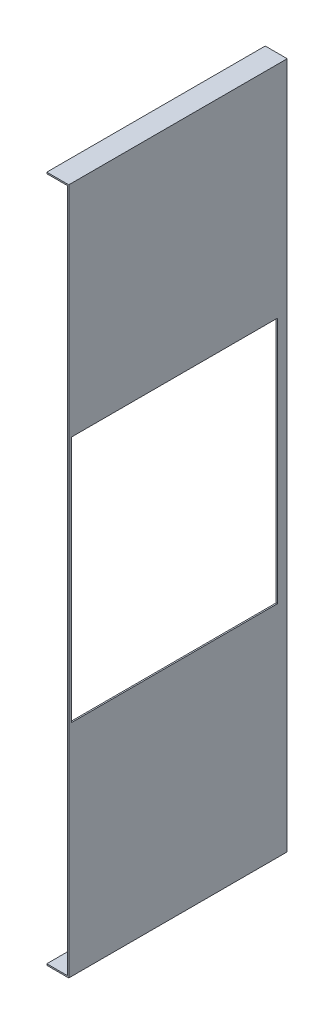
ISO-10303-21;
HEADER;
FILE_DESCRIPTION(('STEP AP214'),'2;1');
FILE_NAME('part.step','',(''),(''),'','','');
FILE_SCHEMA(('AUTOMOTIVE_DESIGN { 1 0 10303 214 1 1 1 1 }'));
ENDSEC;
DATA;
#1=APPLICATION_CONTEXT('core data for automotive mechanical design processes');
#2=APPLICATION_PROTOCOL_DEFINITION('international standard','automotive_design',2000,#1);
#3=PRODUCT_CONTEXT('',#1,'mechanical');
#4=PRODUCT('Part','Part','',(#3));
#5=PRODUCT_RELATED_PRODUCT_CATEGORY('part','',(#4));
#6=PRODUCT_DEFINITION_FORMATION('','',#4);
#7=PRODUCT_DEFINITION_CONTEXT('part definition',#1,'design');
#8=PRODUCT_DEFINITION('design','',#6,#7);
#9=PRODUCT_DEFINITION_SHAPE('','',#8);
#10=(LENGTH_UNIT() NAMED_UNIT(*) SI_UNIT(.MILLI.,.METRE.));
#11=(NAMED_UNIT(*) PLANE_ANGLE_UNIT() SI_UNIT($,.RADIAN.));
#12=(NAMED_UNIT(*) SI_UNIT($,.STERADIAN.) SOLID_ANGLE_UNIT());
#13=UNCERTAINTY_MEASURE_WITH_UNIT(LENGTH_MEASURE(1.E-05),#10,'distance_accuracy_value','');
#14=(GEOMETRIC_REPRESENTATION_CONTEXT(3) GLOBAL_UNCERTAINTY_ASSIGNED_CONTEXT((#13)) GLOBAL_UNIT_ASSIGNED_CONTEXT((#10,
#11,#12)) REPRESENTATION_CONTEXT('',''));
#15=CARTESIAN_POINT('',(0.,0.,0.));
#16=DIRECTION('',(0.,0.,1.));
#17=DIRECTION('',(1.,0.,0.));
#18=AXIS2_PLACEMENT_3D('',#15,#16,#17);
#19=CARTESIAN_POINT('',(0.499999999999998,249.,159.));
#20=DIRECTION('',(-1.,0.,0.));
#21=DIRECTION('',(0.,0.,1.));
#22=AXIS2_PLACEMENT_3D('',#19,#20,#21);
#23=PLANE('',#22);
#24=DIRECTION('',(0.,0.,1.));
#25=VECTOR('',#24,1.);
#26=CARTESIAN_POINT('',(0.499999999999987,89.9999999999998,157.));
#27=LINE('',#26,#25);
#28=CARTESIAN_POINT('',(0.499999999999998,89.9999999999998,7.00000000000001));
#29=VERTEX_POINT('',#28);
#30=CARTESIAN_POINT('',(0.499999999999987,89.9999999999998,157.));
#31=VERTEX_POINT('',#30);
#32=EDGE_CURVE('E141',#29,#31,#27,.T.);
#33=ORIENTED_EDGE('',*,*,#32,.F.);
#34=DIRECTION('',(0.,1.,0.));
#35=VECTOR('',#34,1.);
#36=CARTESIAN_POINT('',(0.499999999999987,89.9999999999998,7.00000000000001));
#37=LINE('',#36,#35);
#38=CARTESIAN_POINT('',(0.50000000000001,-90.0000000000002,6.99999999999998));
#39=VERTEX_POINT('',#38);
#40=EDGE_CURVE('E54',#39,#29,#37,.T.);
#41=ORIENTED_EDGE('',*,*,#40,.F.);
#42=DIRECTION('',(0.,0.,-1.));
#43=VECTOR('',#42,1.);
#44=CARTESIAN_POINT('',(0.50000000000001,-90.0000000000002,157.));
#45=LINE('',#44,#43);
#46=CARTESIAN_POINT('',(0.50000000000001,-90.0000000000002,157.));
#47=VERTEX_POINT('',#46);
#48=EDGE_CURVE('E148',#47,#39,#45,.T.);
#49=ORIENTED_EDGE('',*,*,#48,.F.);
#50=DIRECTION('',(0.,-1.,0.));
#51=VECTOR('',#50,1.);
#52=CARTESIAN_POINT('',(0.499999999999987,89.9999999999998,157.));
#53=LINE('',#52,#51);
#54=EDGE_CURVE('E131',#31,#47,#53,.T.);
#55=ORIENTED_EDGE('',*,*,#54,.F.);
#56=EDGE_LOOP('',(#33,#41,#49,#55));
#57=FACE_BOUND('',#56,.T.);
#58=DIRECTION('',(0.,1.,0.));
#59=VECTOR('',#58,1.);
#60=CARTESIAN_POINT('',(0.499999999999998,249.,0.));
#61=LINE('',#60,#59);
#62=CARTESIAN_POINT('',(0.499999999999998,-250.,0.));
#63=VERTEX_POINT('',#62);
#64=CARTESIAN_POINT('',(0.499999999999998,250.,0.));
#65=VERTEX_POINT('',#64);
#66=EDGE_CURVE('E158',#63,#65,#61,.T.);
#67=ORIENTED_EDGE('',*,*,#66,.T.);
#68=DIRECTION('',(0.,0.,-1.));
#69=VECTOR('',#68,1.);
#70=CARTESIAN_POINT('',(0.499999999999998,250.,159.));
#71=LINE('',#70,#69);
#72=CARTESIAN_POINT('',(0.499999999999998,250.,159.));
#73=VERTEX_POINT('',#72);
#74=EDGE_CURVE('E239',#73,#65,#71,.T.);
#75=ORIENTED_EDGE('',*,*,#74,.F.);
#76=DIRECTION('',(0.,1.,0.));
#77=VECTOR('',#76,1.);
#78=CARTESIAN_POINT('',(0.499999999999998,-249.,159.));
#79=LINE('',#78,#77);
#80=CARTESIAN_POINT('',(0.499999999999998,-250.,159.));
#81=VERTEX_POINT('',#80);
#82=EDGE_CURVE('E163',#81,#73,#79,.T.);
#83=ORIENTED_EDGE('',*,*,#82,.F.);
#84=DIRECTION('',(0.,0.,-1.));
#85=VECTOR('',#84,1.);
#86=CARTESIAN_POINT('',(0.499999999999998,-250.,159.));
#87=LINE('',#86,#85);
#88=EDGE_CURVE('E188',#81,#63,#87,.T.);
#89=ORIENTED_EDGE('',*,*,#88,.T.);
#90=EDGE_LOOP('',(#67,#75,#83,#89));
#91=FACE_BOUND('',#90,.T.);
#92=ADVANCED_FACE('F39',(#57,#91),#23,.F.);
#93=CARTESIAN_POINT('',(0.499999999999998,250.,159.));
#94=DIRECTION('',(0.,-1.,0.));
#95=DIRECTION('',(0.,0.,-1.));
#96=AXIS2_PLACEMENT_3D('',#93,#94,#95);
#97=PLANE('',#96);
#98=DIRECTION('',(-1.,0.,0.));
#99=VECTOR('',#98,1.);
#100=CARTESIAN_POINT('',(0.499999999999998,250.,0.));
#101=LINE('',#100,#99);
#102=CARTESIAN_POINT('',(-15.5,250.,0.));
#103=VERTEX_POINT('',#102);
#104=EDGE_CURVE('E191',#65,#103,#101,.T.);
#105=ORIENTED_EDGE('',*,*,#104,.T.);
#106=DIRECTION('',(0.,0.,-1.));
#107=VECTOR('',#106,1.);
#108=CARTESIAN_POINT('',(-15.5,250.,159.));
#109=LINE('',#108,#107);
#110=CARTESIAN_POINT('',(-15.5,250.,159.));
#111=VERTEX_POINT('',#110);
#112=EDGE_CURVE('E235',#111,#103,#109,.T.);
#113=ORIENTED_EDGE('',*,*,#112,.F.);
#114=DIRECTION('',(-1.,0.,0.));
#115=VECTOR('',#114,1.);
#116=CARTESIAN_POINT('',(0.499999999999998,250.,159.));
#117=LINE('',#116,#115);
#118=EDGE_CURVE('E166',#73,#111,#117,.T.);
#119=ORIENTED_EDGE('',*,*,#118,.F.);
#120=ORIENTED_EDGE('',*,*,#74,.T.);
#121=EDGE_LOOP('',(#105,#113,#119,#120));
#122=FACE_BOUND('',#121,.T.);
#123=ADVANCED_FACE('F270',(#122),#97,.F.);
#124=CARTESIAN_POINT('',(-15.5,249.,159.));
#125=DIRECTION('',(1.,0.,0.));
#126=DIRECTION('',(0.,0.,-1.));
#127=AXIS2_PLACEMENT_3D('',#124,#125,#126);
#128=PLANE('',#127);
#129=DIRECTION('',(0.,-1.,0.));
#130=VECTOR('',#129,1.);
#131=CARTESIAN_POINT('',(-15.5,249.,0.));
#132=LINE('',#131,#130);
#133=CARTESIAN_POINT('',(-15.5,249.,0.));
#134=VERTEX_POINT('',#133);
#135=EDGE_CURVE('E194',#103,#134,#132,.T.);
#136=ORIENTED_EDGE('',*,*,#135,.T.);
#137=DIRECTION('',(0.,0.,-1.));
#138=VECTOR('',#137,1.);
#139=CARTESIAN_POINT('',(-15.5,249.,159.));
#140=LINE('',#139,#138);
#141=CARTESIAN_POINT('',(-15.5,249.,159.));
#142=VERTEX_POINT('',#141);
#143=EDGE_CURVE('E231',#142,#134,#140,.T.);
#144=ORIENTED_EDGE('',*,*,#143,.F.);
#145=DIRECTION('',(0.,-1.,0.));
#146=VECTOR('',#145,1.);
#147=CARTESIAN_POINT('',(-15.5,249.,159.));
#148=LINE('',#147,#146);
#149=EDGE_CURVE('E170',#111,#142,#148,.T.);
#150=ORIENTED_EDGE('',*,*,#149,.F.);
#151=ORIENTED_EDGE('',*,*,#112,.T.);
#152=EDGE_LOOP('',(#136,#144,#150,#151));
#153=FACE_BOUND('',#152,.T.);
#154=ADVANCED_FACE('F274',(#153),#128,.F.);
#155=CARTESIAN_POINT('',(-0.5,249.,159.));
#156=DIRECTION('',(0.,1.,0.));
#157=DIRECTION('',(0.,0.,1.));
#158=AXIS2_PLACEMENT_3D('',#155,#156,#157);
#159=PLANE('',#158);
#160=DIRECTION('',(1.,0.,0.));
#161=VECTOR('',#160,1.);
#162=CARTESIAN_POINT('',(-0.5,249.,0.));
#163=LINE('',#162,#161);
#164=CARTESIAN_POINT('',(-0.5,249.,0.));
#165=VERTEX_POINT('',#164);
#166=EDGE_CURVE('E197',#134,#165,#163,.T.);
#167=ORIENTED_EDGE('',*,*,#166,.T.);
#168=DIRECTION('',(0.,0.,-1.));
#169=VECTOR('',#168,1.);
#170=CARTESIAN_POINT('',(-0.5,249.,159.));
#171=LINE('',#170,#169);
#172=CARTESIAN_POINT('',(-0.5,249.,159.));
#173=VERTEX_POINT('',#172);
#174=EDGE_CURVE('E227',#173,#165,#171,.T.);
#175=ORIENTED_EDGE('',*,*,#174,.F.);
#176=DIRECTION('',(1.,0.,0.));
#177=VECTOR('',#176,1.);
#178=CARTESIAN_POINT('',(-0.5,249.,159.));
#179=LINE('',#178,#177);
#180=EDGE_CURVE('E173',#142,#173,#179,.T.);
#181=ORIENTED_EDGE('',*,*,#180,.F.);
#182=ORIENTED_EDGE('',*,*,#143,.T.);
#183=EDGE_LOOP('',(#167,#175,#181,#182));
#184=FACE_BOUND('',#183,.T.);
#185=ADVANCED_FACE('F279',(#184),#159,.F.);
#186=CARTESIAN_POINT('',(-0.5,249.,159.));
#187=DIRECTION('',(1.,0.,0.));
#188=DIRECTION('',(0.,0.,-1.));
#189=AXIS2_PLACEMENT_3D('',#186,#187,#188);
#190=PLANE('',#189);
#191=DIRECTION('',(0.,0.,-1.));
#192=VECTOR('',#191,1.);
#193=CARTESIAN_POINT('',(-0.5,-90.0000000000002,159.));
#194=LINE('',#193,#192);
#195=CARTESIAN_POINT('',(-0.5,-90.0000000000002,157.));
#196=VERTEX_POINT('',#195);
#197=CARTESIAN_POINT('',(-0.5,-90.0000000000002,6.99999999999998));
#198=VERTEX_POINT('',#197);
#199=EDGE_CURVE('E47',#196,#198,#194,.T.);
#200=ORIENTED_EDGE('',*,*,#199,.T.);
#201=DIRECTION('',(0.,1.,0.));
#202=VECTOR('',#201,1.);
#203=CARTESIAN_POINT('',(-0.5,249.,7.00000000000003));
#204=LINE('',#203,#202);
#205=CARTESIAN_POINT('',(-0.5,89.9999999999998,7.00000000000001));
#206=VERTEX_POINT('',#205);
#207=EDGE_CURVE('E11',#198,#206,#204,.T.);
#208=ORIENTED_EDGE('',*,*,#207,.T.);
#209=DIRECTION('',(0.,0.,1.));
#210=VECTOR('',#209,1.);
#211=CARTESIAN_POINT('',(-0.5,89.9999999999998,159.));
#212=LINE('',#211,#210);
#213=CARTESIAN_POINT('',(-0.5,89.9999999999998,157.));
#214=VERTEX_POINT('',#213);
#215=EDGE_CURVE('E243',#206,#214,#212,.T.);
#216=ORIENTED_EDGE('',*,*,#215,.T.);
#217=DIRECTION('',(0.,-1.,0.));
#218=VECTOR('',#217,1.);
#219=CARTESIAN_POINT('',(-0.5,249.,157.));
#220=LINE('',#219,#218);
#221=EDGE_CURVE('E134',#214,#196,#220,.T.);
#222=ORIENTED_EDGE('',*,*,#221,.T.);
#223=EDGE_LOOP('',(#200,#208,#216,#222));
#224=FACE_BOUND('',#223,.T.);
#225=DIRECTION('',(0.,-1.,0.));
#226=VECTOR('',#225,1.);
#227=CARTESIAN_POINT('',(-0.5,249.,0.));
#228=LINE('',#227,#226);
#229=CARTESIAN_POINT('',(-0.5,-249.,0.));
#230=VERTEX_POINT('',#229);
#231=EDGE_CURVE('E200',#165,#230,#228,.T.);
#232=ORIENTED_EDGE('',*,*,#231,.T.);
#233=DIRECTION('',(0.,0.,-1.));
#234=VECTOR('',#233,1.);
#235=CARTESIAN_POINT('',(-0.5,-249.,159.));
#236=LINE('',#235,#234);
#237=CARTESIAN_POINT('',(-0.5,-249.,159.));
#238=VERTEX_POINT('',#237);
#239=EDGE_CURVE('E223',#238,#230,#236,.T.);
#240=ORIENTED_EDGE('',*,*,#239,.F.);
#241=DIRECTION('',(0.,-1.,0.));
#242=VECTOR('',#241,1.);
#243=CARTESIAN_POINT('',(-0.5,249.,159.));
#244=LINE('',#243,#242);
#245=EDGE_CURVE('E176',#173,#238,#244,.T.);
#246=ORIENTED_EDGE('',*,*,#245,.F.);
#247=ORIENTED_EDGE('',*,*,#174,.T.);
#248=EDGE_LOOP('',(#232,#240,#246,#247));
#249=FACE_BOUND('',#248,.T.);
#250=ADVANCED_FACE('F250',(#224,#249),#190,.F.);
#251=CARTESIAN_POINT('',(-0.5,-249.,159.));
#252=DIRECTION('',(0.,-1.,0.));
#253=DIRECTION('',(0.,0.,-1.));
#254=AXIS2_PLACEMENT_3D('',#251,#252,#253);
#255=PLANE('',#254);
#256=DIRECTION('',(-1.,0.,0.));
#257=VECTOR('',#256,1.);
#258=CARTESIAN_POINT('',(-0.5,-249.,0.));
#259=LINE('',#258,#257);
#260=CARTESIAN_POINT('',(-15.5,-249.,0.));
#261=VERTEX_POINT('',#260);
#262=EDGE_CURVE('E203',#230,#261,#259,.T.);
#263=ORIENTED_EDGE('',*,*,#262,.T.);
#264=DIRECTION('',(0.,0.,-1.));
#265=VECTOR('',#264,1.);
#266=CARTESIAN_POINT('',(-15.5,-249.,159.));
#267=LINE('',#266,#265);
#268=CARTESIAN_POINT('',(-15.5,-249.,159.));
#269=VERTEX_POINT('',#268);
#270=EDGE_CURVE('E219',#269,#261,#267,.T.);
#271=ORIENTED_EDGE('',*,*,#270,.F.);
#272=DIRECTION('',(-1.,0.,0.));
#273=VECTOR('',#272,1.);
#274=CARTESIAN_POINT('',(-0.5,-249.,159.));
#275=LINE('',#274,#273);
#276=EDGE_CURVE('E179',#238,#269,#275,.T.);
#277=ORIENTED_EDGE('',*,*,#276,.F.);
#278=ORIENTED_EDGE('',*,*,#239,.T.);
#279=EDGE_LOOP('',(#263,#271,#277,#278));
#280=FACE_BOUND('',#279,.T.);
#281=ADVANCED_FACE('F288',(#280),#255,.F.);
#282=CARTESIAN_POINT('',(-15.5,-249.,159.));
#283=DIRECTION('',(1.,0.,0.));
#284=DIRECTION('',(0.,0.,-1.));
#285=AXIS2_PLACEMENT_3D('',#282,#283,#284);
#286=PLANE('',#285);
#287=DIRECTION('',(0.,-1.,0.));
#288=VECTOR('',#287,1.);
#289=CARTESIAN_POINT('',(-15.5,-249.,0.));
#290=LINE('',#289,#288);
#291=CARTESIAN_POINT('',(-15.5,-250.,0.));
#292=VERTEX_POINT('',#291);
#293=EDGE_CURVE('E206',#261,#292,#290,.T.);
#294=ORIENTED_EDGE('',*,*,#293,.T.);
#295=DIRECTION('',(0.,0.,-1.));
#296=VECTOR('',#295,1.);
#297=CARTESIAN_POINT('',(-15.5,-250.,159.));
#298=LINE('',#297,#296);
#299=CARTESIAN_POINT('',(-15.5,-250.,159.));
#300=VERTEX_POINT('',#299);
#301=EDGE_CURVE('E215',#300,#292,#298,.T.);
#302=ORIENTED_EDGE('',*,*,#301,.F.);
#303=DIRECTION('',(0.,-1.,0.));
#304=VECTOR('',#303,1.);
#305=CARTESIAN_POINT('',(-15.5,-249.,159.));
#306=LINE('',#305,#304);
#307=EDGE_CURVE('E182',#269,#300,#306,.T.);
#308=ORIENTED_EDGE('',*,*,#307,.F.);
#309=ORIENTED_EDGE('',*,*,#270,.T.);
#310=EDGE_LOOP('',(#294,#302,#308,#309));
#311=FACE_BOUND('',#310,.T.);
#312=ADVANCED_FACE('F291',(#311),#286,.F.);
#313=CARTESIAN_POINT('',(0.499999999999998,-250.,159.));
#314=DIRECTION('',(0.,1.,0.));
#315=DIRECTION('',(0.,0.,1.));
#316=AXIS2_PLACEMENT_3D('',#313,#314,#315);
#317=PLANE('',#316);
#318=DIRECTION('',(1.,0.,0.));
#319=VECTOR('',#318,1.);
#320=CARTESIAN_POINT('',(0.499999999999998,-250.,0.));
#321=LINE('',#320,#319);
#322=EDGE_CURVE('E167',#292,#63,#321,.T.);
#323=ORIENTED_EDGE('',*,*,#322,.T.);
#324=ORIENTED_EDGE('',*,*,#88,.F.);
#325=DIRECTION('',(1.,0.,0.));
#326=VECTOR('',#325,1.);
#327=CARTESIAN_POINT('',(0.499999999999998,-250.,159.));
#328=LINE('',#327,#326);
#329=EDGE_CURVE('E185',#300,#81,#328,.T.);
#330=ORIENTED_EDGE('',*,*,#329,.F.);
#331=ORIENTED_EDGE('',*,*,#301,.T.);
#332=EDGE_LOOP('',(#323,#324,#330,#331));
#333=FACE_BOUND('',#332,.T.);
#334=ADVANCED_FACE('F295',(#333),#317,.F.);
#335=CARTESIAN_POINT('',(0.,0.,159.));
#336=DIRECTION('',(0.,0.,-1.));
#337=DIRECTION('',(-1.,0.,0.));
#338=AXIS2_PLACEMENT_3D('',#335,#336,#337);
#339=PLANE('',#338);
#340=ORIENTED_EDGE('',*,*,#82,.T.);
#341=ORIENTED_EDGE('',*,*,#118,.T.);
#342=ORIENTED_EDGE('',*,*,#149,.T.);
#343=ORIENTED_EDGE('',*,*,#180,.T.);
#344=ORIENTED_EDGE('',*,*,#245,.T.);
#345=ORIENTED_EDGE('',*,*,#276,.T.);
#346=ORIENTED_EDGE('',*,*,#307,.T.);
#347=ORIENTED_EDGE('',*,*,#329,.T.);
#348=EDGE_LOOP('',(#340,#341,#342,#343,#344,#345,#346,#347));
#349=FACE_BOUND('',#348,.T.);
#350=ADVANCED_FACE('F264',(#349),#339,.F.);
#351=CARTESIAN_POINT('',(0.,0.,0.));
#352=DIRECTION('',(0.,0.,-1.));
#353=DIRECTION('',(-1.,0.,0.));
#354=AXIS2_PLACEMENT_3D('',#351,#352,#353);
#355=PLANE('',#354);
#356=ORIENTED_EDGE('',*,*,#66,.F.);
#357=ORIENTED_EDGE('',*,*,#322,.F.);
#358=ORIENTED_EDGE('',*,*,#293,.F.);
#359=ORIENTED_EDGE('',*,*,#262,.F.);
#360=ORIENTED_EDGE('',*,*,#231,.F.);
#361=ORIENTED_EDGE('',*,*,#166,.F.);
#362=ORIENTED_EDGE('',*,*,#135,.F.);
#363=ORIENTED_EDGE('',*,*,#104,.F.);
#364=EDGE_LOOP('',(#356,#357,#358,#359,#360,#361,#362,#363));
#365=FACE_BOUND('',#364,.T.);
#366=ADVANCED_FACE('F257',(#365),#355,.T.);
#367=CARTESIAN_POINT('',(-15.5,89.9999999999998,7.00000000000001));
#368=DIRECTION('',(0.,0.,-1.));
#369=DIRECTION('',(0.,1.,0.));
#370=AXIS2_PLACEMENT_3D('',#367,#368,#369);
#371=PLANE('',#370);
#372=DIRECTION('',(1.,0.,0.));
#373=VECTOR('',#372,1.);
#374=CARTESIAN_POINT('',(-15.5,-90.0000000000002,6.99999999999998));
#375=LINE('',#374,#373);
#376=EDGE_CURVE('E155',#198,#39,#375,.T.);
#377=ORIENTED_EDGE('',*,*,#376,.T.);
#378=ORIENTED_EDGE('',*,*,#40,.T.);
#379=DIRECTION('',(1.,0.,0.));
#380=VECTOR('',#379,1.);
#381=CARTESIAN_POINT('',(-15.5,89.9999999999998,7.00000000000001));
#382=LINE('',#381,#380);
#383=EDGE_CURVE('E138',#206,#29,#382,.T.);
#384=ORIENTED_EDGE('',*,*,#383,.F.);
#385=ORIENTED_EDGE('',*,*,#207,.F.);
#386=EDGE_LOOP('',(#377,#378,#384,#385));
#387=FACE_BOUND('',#386,.T.);
#388=ADVANCED_FACE('F255',(#387),#371,.F.);
#389=CARTESIAN_POINT('',(-15.5,-90.0000000000002,157.));
#390=DIRECTION('',(0.,-1.,0.));
#391=DIRECTION('',(1.,0.,0.));
#392=AXIS2_PLACEMENT_3D('',#389,#390,#391);
#393=PLANE('',#392);
#394=DIRECTION('',(1.,0.,0.));
#395=VECTOR('',#394,1.);
#396=CARTESIAN_POINT('',(-15.5,-90.0000000000002,157.));
#397=LINE('',#396,#395);
#398=EDGE_CURVE('E137',#196,#47,#397,.T.);
#399=ORIENTED_EDGE('',*,*,#398,.T.);
#400=ORIENTED_EDGE('',*,*,#48,.T.);
#401=ORIENTED_EDGE('',*,*,#376,.F.);
#402=ORIENTED_EDGE('',*,*,#199,.F.);
#403=EDGE_LOOP('',(#399,#400,#401,#402));
#404=FACE_BOUND('',#403,.T.);
#405=ADVANCED_FACE('F254',(#404),#393,.F.);
#406=CARTESIAN_POINT('',(-15.5,89.9999999999998,157.));
#407=DIRECTION('',(0.,0.,1.));
#408=DIRECTION('',(0.,-1.,0.));
#409=AXIS2_PLACEMENT_3D('',#406,#407,#408);
#410=PLANE('',#409);
#411=DIRECTION('',(1.,0.,0.));
#412=VECTOR('',#411,1.);
#413=CARTESIAN_POINT('',(-15.5,89.9999999999998,157.));
#414=LINE('',#413,#412);
#415=EDGE_CURVE('E62',#214,#31,#414,.T.);
#416=ORIENTED_EDGE('',*,*,#415,.T.);
#417=ORIENTED_EDGE('',*,*,#54,.T.);
#418=ORIENTED_EDGE('',*,*,#398,.F.);
#419=ORIENTED_EDGE('',*,*,#221,.F.);
#420=EDGE_LOOP('',(#416,#417,#418,#419));
#421=FACE_BOUND('',#420,.T.);
#422=ADVANCED_FACE('F128',(#421),#410,.F.);
#423=CARTESIAN_POINT('',(-15.5,89.9999999999998,157.));
#424=DIRECTION('',(0.,1.,0.));
#425=DIRECTION('',(-1.,0.,0.));
#426=AXIS2_PLACEMENT_3D('',#423,#424,#425);
#427=PLANE('',#426);
#428=ORIENTED_EDGE('',*,*,#383,.T.);
#429=ORIENTED_EDGE('',*,*,#32,.T.);
#430=ORIENTED_EDGE('',*,*,#415,.F.);
#431=ORIENTED_EDGE('',*,*,#215,.F.);
#432=EDGE_LOOP('',(#428,#429,#430,#431));
#433=FACE_BOUND('',#432,.T.);
#434=ADVANCED_FACE('F142',(#433),#427,.F.);
#435=CLOSED_SHELL('',(#92,#123,#154,#185,#250,#281,#312,#334,#350,#366,#388,#405,#422,#434));
#436=MANIFOLD_SOLID_BREP('B2',#435);
#437=ADVANCED_BREP_SHAPE_REPRESENTATION('',(#18,#436),#14);
#438=SHAPE_DEFINITION_REPRESENTATION(#9,#437);
ENDSEC;
END-ISO-10303-21;
